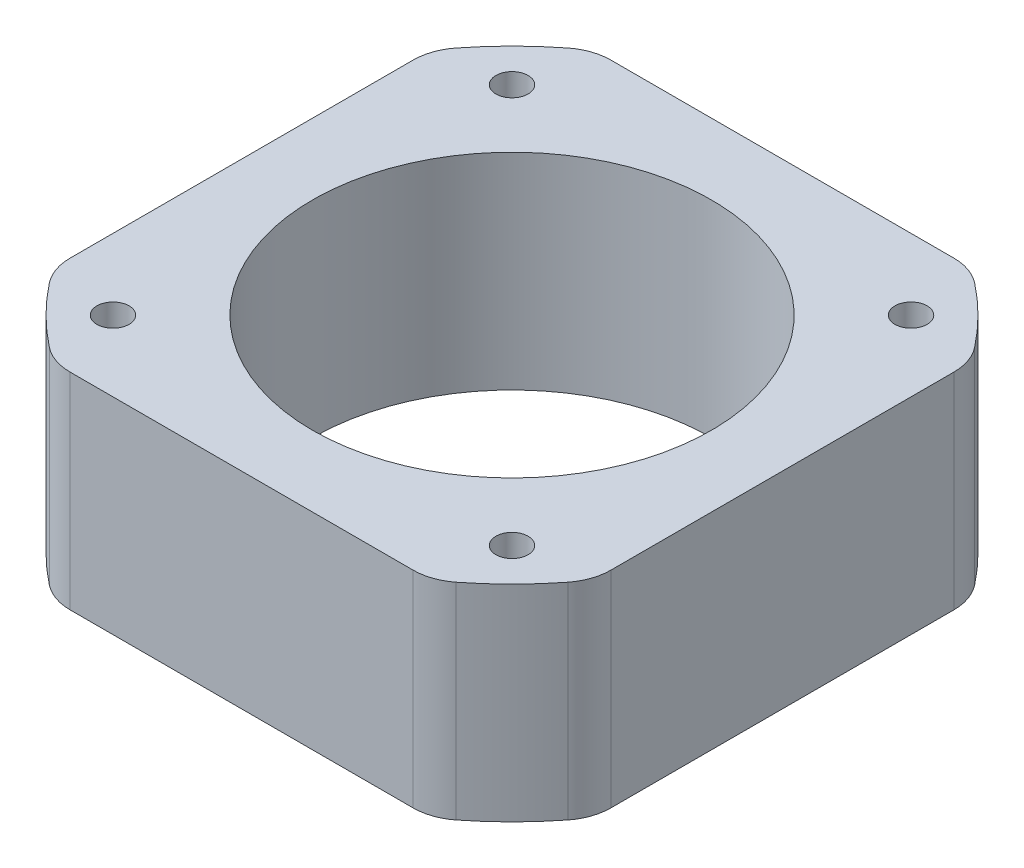
ISO-10303-21;
HEADER;
FILE_DESCRIPTION(('STEP AP214'),'2;1');
FILE_NAME('part.step','',(''),(''),'','','');
FILE_SCHEMA(('AUTOMOTIVE_DESIGN { 1 0 10303 214 1 1 1 1 }'));
ENDSEC;
DATA;
#1=APPLICATION_CONTEXT('core data for automotive mechanical design processes');
#2=APPLICATION_PROTOCOL_DEFINITION('international standard','automotive_design',2000,#1);
#3=PRODUCT_CONTEXT('',#1,'mechanical');
#4=PRODUCT('Part','Part','',(#3));
#5=PRODUCT_RELATED_PRODUCT_CATEGORY('part','',(#4));
#6=PRODUCT_DEFINITION_FORMATION('','',#4);
#7=PRODUCT_DEFINITION_CONTEXT('part definition',#1,'design');
#8=PRODUCT_DEFINITION('design','',#6,#7);
#9=PRODUCT_DEFINITION_SHAPE('','',#8);
#10=(LENGTH_UNIT() NAMED_UNIT(*) SI_UNIT(.MILLI.,.METRE.));
#11=(NAMED_UNIT(*) PLANE_ANGLE_UNIT() SI_UNIT($,.RADIAN.));
#12=(NAMED_UNIT(*) SI_UNIT($,.STERADIAN.) SOLID_ANGLE_UNIT());
#13=UNCERTAINTY_MEASURE_WITH_UNIT(LENGTH_MEASURE(1.E-05),#10,'distance_accuracy_value','');
#14=(GEOMETRIC_REPRESENTATION_CONTEXT(3) GLOBAL_UNCERTAINTY_ASSIGNED_CONTEXT((#13)) GLOBAL_UNIT_ASSIGNED_CONTEXT((#10,
#11,#12)) REPRESENTATION_CONTEXT('',''));
#15=CARTESIAN_POINT('',(0.,0.,0.));
#16=DIRECTION('',(0.,0.,1.));
#17=DIRECTION('',(1.,0.,0.));
#18=AXIS2_PLACEMENT_3D('',#15,#16,#17);
#19=CARTESIAN_POINT('',(0.,16.,0.));
#20=DIRECTION('',(0.,1.,0.));
#21=DIRECTION('',(0.,0.,1.));
#22=AXIS2_PLACEMENT_3D('',#19,#20,#21);
#23=PLANE('',#22);
#24=CARTESIAN_POINT('',(15.5,16.,15.5));
#25=DIRECTION('',(0.,1.,0.));
#26=DIRECTION('',(0.,0.,1.));
#27=AXIS2_PLACEMENT_3D('',#24,#25,#26);
#28=CIRCLE('',#27,1.25000000000001);
#29=CARTESIAN_POINT('',(15.5,16.,16.75));
#30=VERTEX_POINT('',#29);
#31=EDGE_CURVE('E319',#30,#30,#28,.T.);
#32=ORIENTED_EDGE('',*,*,#31,.F.);
#33=EDGE_LOOP('',(#32));
#34=FACE_BOUND('',#33,.T.);
#35=CARTESIAN_POINT('',(-15.5,16.,-15.5));
#36=DIRECTION('',(0.,1.,0.));
#37=DIRECTION('',(0.,0.,1.));
#38=AXIS2_PLACEMENT_3D('',#35,#36,#37);
#39=CIRCLE('',#38,1.25000000000001);
#40=CARTESIAN_POINT('',(-15.5,16.,-14.25));
#41=VERTEX_POINT('',#40);
#42=EDGE_CURVE('E307',#41,#41,#39,.T.);
#43=ORIENTED_EDGE('',*,*,#42,.F.);
#44=EDGE_LOOP('',(#43));
#45=FACE_BOUND('',#44,.T.);
#46=CARTESIAN_POINT('',(0.,16.,0.));
#47=DIRECTION('',(0.,1.,0.));
#48=DIRECTION('',(0.,0.,1.));
#49=AXIS2_PLACEMENT_3D('',#46,#47,#48);
#50=CIRCLE('',#49,25.6);
#51=CARTESIAN_POINT('',(-15.7927871574424,16.,-20.1481481481481));
#52=VERTEX_POINT('',#51);
#53=CARTESIAN_POINT('',(-20.1481481481482,16.,-15.7927871574423));
#54=VERTEX_POINT('',#53);
#55=EDGE_CURVE('E295',#52,#54,#50,.T.);
#56=ORIENTED_EDGE('',*,*,#55,.T.);
#57=CARTESIAN_POINT('',(-17.,16.,-13.325164164092));
#58=DIRECTION('',(0.,1.,0.));
#59=DIRECTION('',(0.,0.,1.));
#60=AXIS2_PLACEMENT_3D('',#57,#58,#59);
#61=CIRCLE('',#60,4.);
#62=CARTESIAN_POINT('',(-21.,16.,-13.325164164092));
#63=VERTEX_POINT('',#62);
#64=EDGE_CURVE('E223',#54,#63,#61,.T.);
#65=ORIENTED_EDGE('',*,*,#64,.T.);
#66=DIRECTION('',(0.,0.,1.));
#67=VECTOR('',#66,1.);
#68=CARTESIAN_POINT('',(-21.,16.,14.641038214553));
#69=LINE('',#68,#67);
#70=CARTESIAN_POINT('',(-21.,16.,13.325164164092));
#71=VERTEX_POINT('',#70);
#72=EDGE_CURVE('E168',#63,#71,#69,.T.);
#73=ORIENTED_EDGE('',*,*,#72,.T.);
#74=CARTESIAN_POINT('',(-17.,16.,13.325164164092));
#75=DIRECTION('',(0.,1.,0.));
#76=DIRECTION('',(0.,0.,1.));
#77=AXIS2_PLACEMENT_3D('',#74,#75,#76);
#78=CIRCLE('',#77,4.);
#79=CARTESIAN_POINT('',(-20.1481481481482,16.,15.7927871574423));
#80=VERTEX_POINT('',#79);
#81=EDGE_CURVE('E210',#71,#80,#78,.T.);
#82=ORIENTED_EDGE('',*,*,#81,.T.);
#83=CARTESIAN_POINT('',(0.,16.,0.));
#84=DIRECTION('',(0.,1.,0.));
#85=DIRECTION('',(0.,0.,1.));
#86=AXIS2_PLACEMENT_3D('',#83,#84,#85);
#87=CIRCLE('',#86,25.6);
#88=CARTESIAN_POINT('',(-15.7927871574423,16.,20.1481481481482));
#89=VERTEX_POINT('',#88);
#90=EDGE_CURVE('E255',#80,#89,#87,.T.);
#91=ORIENTED_EDGE('',*,*,#90,.T.);
#92=CARTESIAN_POINT('',(-13.325164164092,16.,17.));
#93=DIRECTION('',(0.,1.,0.));
#94=DIRECTION('',(0.,0.,1.));
#95=AXIS2_PLACEMENT_3D('',#92,#93,#94);
#96=CIRCLE('',#95,4.);
#97=CARTESIAN_POINT('',(-13.325164164092,16.,21.));
#98=VERTEX_POINT('',#97);
#99=EDGE_CURVE('E212',#89,#98,#96,.T.);
#100=ORIENTED_EDGE('',*,*,#99,.T.);
#101=DIRECTION('',(1.,0.,0.));
#102=VECTOR('',#101,1.);
#103=CARTESIAN_POINT('',(-14.641038214553,16.,21.));
#104=LINE('',#103,#102);
#105=CARTESIAN_POINT('',(13.3251641640919,16.,21.));
#106=VERTEX_POINT('',#105);
#107=EDGE_CURVE('E268',#98,#106,#104,.T.);
#108=ORIENTED_EDGE('',*,*,#107,.T.);
#109=CARTESIAN_POINT('',(13.3251641640919,16.,17.));
#110=DIRECTION('',(0.,1.,0.));
#111=DIRECTION('',(0.,0.,1.));
#112=AXIS2_PLACEMENT_3D('',#109,#110,#111);
#113=CIRCLE('',#112,4.);
#114=CARTESIAN_POINT('',(15.7927871574423,16.,20.1481481481482));
#115=VERTEX_POINT('',#114);
#116=EDGE_CURVE('E214',#106,#115,#113,.T.);
#117=ORIENTED_EDGE('',*,*,#116,.T.);
#118=CARTESIAN_POINT('',(0.,16.,0.));
#119=DIRECTION('',(0.,1.,0.));
#120=DIRECTION('',(0.,0.,1.));
#121=AXIS2_PLACEMENT_3D('',#118,#119,#120);
#122=CIRCLE('',#121,25.6);
#123=CARTESIAN_POINT('',(20.1481481481481,16.,15.7927871574423));
#124=VERTEX_POINT('',#123);
#125=EDGE_CURVE('E270',#115,#124,#122,.T.);
#126=ORIENTED_EDGE('',*,*,#125,.T.);
#127=CARTESIAN_POINT('',(17.,16.,13.3251641640919));
#128=DIRECTION('',(0.,1.,0.));
#129=DIRECTION('',(0.,0.,1.));
#130=AXIS2_PLACEMENT_3D('',#127,#128,#129);
#131=CIRCLE('',#130,4.);
#132=CARTESIAN_POINT('',(21.,16.,13.3251641640919));
#133=VERTEX_POINT('',#132);
#134=EDGE_CURVE('E56',#124,#133,#131,.T.);
#135=ORIENTED_EDGE('',*,*,#134,.T.);
#136=DIRECTION('',(0.,0.,-1.));
#137=VECTOR('',#136,1.);
#138=CARTESIAN_POINT('',(21.,16.,14.641038214553));
#139=LINE('',#138,#137);
#140=CARTESIAN_POINT('',(21.,16.,-13.3251641640919));
#141=VERTEX_POINT('',#140);
#142=EDGE_CURVE('E193',#133,#141,#139,.T.);
#143=ORIENTED_EDGE('',*,*,#142,.T.);
#144=CARTESIAN_POINT('',(17.,16.,-13.3251641640919));
#145=DIRECTION('',(0.,1.,0.));
#146=DIRECTION('',(0.,0.,1.));
#147=AXIS2_PLACEMENT_3D('',#144,#145,#146);
#148=CIRCLE('',#147,4.);
#149=CARTESIAN_POINT('',(20.1481481481481,16.,-15.7927871574423));
#150=VERTEX_POINT('',#149);
#151=EDGE_CURVE('E217',#141,#150,#148,.T.);
#152=ORIENTED_EDGE('',*,*,#151,.T.);
#153=CARTESIAN_POINT('',(0.,16.,0.));
#154=DIRECTION('',(0.,1.,0.));
#155=DIRECTION('',(0.,0.,1.));
#156=AXIS2_PLACEMENT_3D('',#153,#154,#155);
#157=CIRCLE('',#156,25.6);
#158=CARTESIAN_POINT('',(15.7927871574423,16.,-20.1481481481481));
#159=VERTEX_POINT('',#158);
#160=EDGE_CURVE('E192',#150,#159,#157,.T.);
#161=ORIENTED_EDGE('',*,*,#160,.T.);
#162=CARTESIAN_POINT('',(13.3251641640919,16.,-17.));
#163=DIRECTION('',(0.,1.,0.));
#164=DIRECTION('',(0.,0.,1.));
#165=AXIS2_PLACEMENT_3D('',#162,#163,#164);
#166=CIRCLE('',#165,4.);
#167=CARTESIAN_POINT('',(13.3251641640919,16.,-21.));
#168=VERTEX_POINT('',#167);
#169=EDGE_CURVE('E219',#159,#168,#166,.T.);
#170=ORIENTED_EDGE('',*,*,#169,.T.);
#171=DIRECTION('',(-1.,0.,0.));
#172=VECTOR('',#171,1.);
#173=CARTESIAN_POINT('',(-14.641038214553,16.,-21.));
#174=LINE('',#173,#172);
#175=CARTESIAN_POINT('',(-13.325164164092,16.,-21.));
#176=VERTEX_POINT('',#175);
#177=EDGE_CURVE('E296',#168,#176,#174,.T.);
#178=ORIENTED_EDGE('',*,*,#177,.T.);
#179=CARTESIAN_POINT('',(-13.325164164092,16.,-17.));
#180=DIRECTION('',(0.,1.,0.));
#181=DIRECTION('',(0.,0.,1.));
#182=AXIS2_PLACEMENT_3D('',#179,#180,#181);
#183=CIRCLE('',#182,4.);
#184=EDGE_CURVE('E221',#176,#52,#183,.T.);
#185=ORIENTED_EDGE('',*,*,#184,.T.);
#186=EDGE_LOOP('',(#56,#65,#73,#82,#91,#100,#108,#117,#126,#135,#143,#152,#161,#170,#178,#185));
#187=FACE_BOUND('',#186,.T.);
#188=CARTESIAN_POINT('',(0.,16.,0.));
#189=DIRECTION('',(0.,1.,0.));
#190=DIRECTION('',(0.,0.,1.));
#191=AXIS2_PLACEMENT_3D('',#188,#189,#190);
#192=CIRCLE('',#191,15.5);
#193=CARTESIAN_POINT('',(0.,16.,15.5));
#194=VERTEX_POINT('',#193);
#195=EDGE_CURVE('E279',#194,#194,#192,.T.);
#196=ORIENTED_EDGE('',*,*,#195,.F.);
#197=EDGE_LOOP('',(#196));
#198=FACE_BOUND('',#197,.T.);
#199=CARTESIAN_POINT('',(15.5,16.,-15.5));
#200=DIRECTION('',(0.,1.,0.));
#201=DIRECTION('',(0.,0.,1.));
#202=AXIS2_PLACEMENT_3D('',#199,#200,#201);
#203=CIRCLE('',#202,1.25000000000001);
#204=CARTESIAN_POINT('',(15.5,16.,-14.25));
#205=VERTEX_POINT('',#204);
#206=EDGE_CURVE('E313',#205,#205,#203,.T.);
#207=ORIENTED_EDGE('',*,*,#206,.F.);
#208=EDGE_LOOP('',(#207));
#209=FACE_BOUND('',#208,.T.);
#210=CARTESIAN_POINT('',(-15.5,16.,15.5));
#211=DIRECTION('',(0.,1.,0.));
#212=DIRECTION('',(0.,0.,1.));
#213=AXIS2_PLACEMENT_3D('',#210,#211,#212);
#214=CIRCLE('',#213,1.25000000000001);
#215=CARTESIAN_POINT('',(-15.5,16.,16.75));
#216=VERTEX_POINT('',#215);
#217=EDGE_CURVE('E325',#216,#216,#214,.T.);
#218=ORIENTED_EDGE('',*,*,#217,.F.);
#219=EDGE_LOOP('',(#218));
#220=FACE_BOUND('',#219,.T.);
#221=ADVANCED_FACE('F34',(#34,#45,#187,#198,#209,#220),#23,.T.);
#222=CARTESIAN_POINT('',(0.,0.,0.));
#223=DIRECTION('',(0.,1.,0.));
#224=DIRECTION('',(0.,0.,1.));
#225=AXIS2_PLACEMENT_3D('',#222,#223,#224);
#226=PLANE('',#225);
#227=CARTESIAN_POINT('',(15.5,0.,15.5));
#228=DIRECTION('',(0.,1.,0.));
#229=DIRECTION('',(0.,0.,1.));
#230=AXIS2_PLACEMENT_3D('',#227,#228,#229);
#231=CIRCLE('',#230,1.25000000000001);
#232=CARTESIAN_POINT('',(15.5,0.,16.75));
#233=VERTEX_POINT('',#232);
#234=EDGE_CURVE('E322',#233,#233,#231,.T.);
#235=ORIENTED_EDGE('',*,*,#234,.T.);
#236=EDGE_LOOP('',(#235));
#237=FACE_BOUND('',#236,.T.);
#238=CARTESIAN_POINT('',(-15.5,0.,-15.5));
#239=DIRECTION('',(0.,1.,0.));
#240=DIRECTION('',(0.,0.,1.));
#241=AXIS2_PLACEMENT_3D('',#238,#239,#240);
#242=CIRCLE('',#241,1.25000000000001);
#243=CARTESIAN_POINT('',(-15.5,0.,-14.25));
#244=VERTEX_POINT('',#243);
#245=EDGE_CURVE('E310',#244,#244,#242,.T.);
#246=ORIENTED_EDGE('',*,*,#245,.T.);
#247=EDGE_LOOP('',(#246));
#248=FACE_BOUND('',#247,.T.);
#249=DIRECTION('',(0.,0.,1.));
#250=VECTOR('',#249,1.);
#251=CARTESIAN_POINT('',(-21.,0.,14.641038214553));
#252=LINE('',#251,#250);
#253=CARTESIAN_POINT('',(-21.,0.,-13.325164164092));
#254=VERTEX_POINT('',#253);
#255=CARTESIAN_POINT('',(-21.,0.,13.325164164092));
#256=VERTEX_POINT('',#255);
#257=EDGE_CURVE('E165',#254,#256,#252,.T.);
#258=ORIENTED_EDGE('',*,*,#257,.F.);
#259=CARTESIAN_POINT('',(-17.,0.,-13.325164164092));
#260=DIRECTION('',(0.,1.,0.));
#261=DIRECTION('',(0.,0.,1.));
#262=AXIS2_PLACEMENT_3D('',#259,#260,#261);
#263=CIRCLE('',#262,4.);
#264=CARTESIAN_POINT('',(-20.1481481481482,0.,-15.7927871574423));
#265=VERTEX_POINT('',#264);
#266=EDGE_CURVE('E148',#254,#265,#263,.F.);
#267=ORIENTED_EDGE('',*,*,#266,.T.);
#268=CARTESIAN_POINT('',(0.,0.,0.));
#269=DIRECTION('',(0.,1.,0.));
#270=DIRECTION('',(0.,0.,1.));
#271=AXIS2_PLACEMENT_3D('',#268,#269,#270);
#272=CIRCLE('',#271,25.6);
#273=CARTESIAN_POINT('',(-15.7927871574424,0.,-20.1481481481481));
#274=VERTEX_POINT('',#273);
#275=EDGE_CURVE('E176',#274,#265,#272,.T.);
#276=ORIENTED_EDGE('',*,*,#275,.F.);
#277=CARTESIAN_POINT('',(-13.325164164092,0.,-17.));
#278=DIRECTION('',(0.,1.,0.));
#279=DIRECTION('',(0.,0.,1.));
#280=AXIS2_PLACEMENT_3D('',#277,#278,#279);
#281=CIRCLE('',#280,4.);
#282=CARTESIAN_POINT('',(-13.325164164092,0.,-21.));
#283=VERTEX_POINT('',#282);
#284=EDGE_CURVE('E159',#274,#283,#281,.F.);
#285=ORIENTED_EDGE('',*,*,#284,.T.);
#286=DIRECTION('',(-1.,0.,0.));
#287=VECTOR('',#286,1.);
#288=CARTESIAN_POINT('',(-14.641038214553,0.,-21.));
#289=LINE('',#288,#287);
#290=CARTESIAN_POINT('',(13.3251641640919,0.,-21.));
#291=VERTEX_POINT('',#290);
#292=EDGE_CURVE('E181',#291,#283,#289,.T.);
#293=ORIENTED_EDGE('',*,*,#292,.F.);
#294=CARTESIAN_POINT('',(13.3251641640919,0.,-17.));
#295=DIRECTION('',(0.,1.,0.));
#296=DIRECTION('',(0.,0.,1.));
#297=AXIS2_PLACEMENT_3D('',#294,#295,#296);
#298=CIRCLE('',#297,4.);
#299=CARTESIAN_POINT('',(15.7927871574423,0.,-20.1481481481481));
#300=VERTEX_POINT('',#299);
#301=EDGE_CURVE('E204',#291,#300,#298,.F.);
#302=ORIENTED_EDGE('',*,*,#301,.T.);
#303=CARTESIAN_POINT('',(0.,0.,0.));
#304=DIRECTION('',(0.,1.,0.));
#305=DIRECTION('',(0.,0.,1.));
#306=AXIS2_PLACEMENT_3D('',#303,#304,#305);
#307=CIRCLE('',#306,25.6);
#308=CARTESIAN_POINT('',(20.1481481481481,0.,-15.7927871574423));
#309=VERTEX_POINT('',#308);
#310=EDGE_CURVE('E277',#309,#300,#307,.T.);
#311=ORIENTED_EDGE('',*,*,#310,.F.);
#312=CARTESIAN_POINT('',(17.,0.,-13.3251641640919));
#313=DIRECTION('',(0.,1.,0.));
#314=DIRECTION('',(0.,0.,1.));
#315=AXIS2_PLACEMENT_3D('',#312,#313,#314);
#316=CIRCLE('',#315,4.);
#317=CARTESIAN_POINT('',(21.,0.,-13.3251641640919));
#318=VERTEX_POINT('',#317);
#319=EDGE_CURVE('E202',#309,#318,#316,.F.);
#320=ORIENTED_EDGE('',*,*,#319,.T.);
#321=DIRECTION('',(0.,0.,-1.));
#322=VECTOR('',#321,1.);
#323=CARTESIAN_POINT('',(21.,0.,14.641038214553));
#324=LINE('',#323,#322);
#325=CARTESIAN_POINT('',(21.,0.,13.3251641640919));
#326=VERTEX_POINT('',#325);
#327=EDGE_CURVE('E190',#326,#318,#324,.T.);
#328=ORIENTED_EDGE('',*,*,#327,.F.);
#329=CARTESIAN_POINT('',(17.,0.,13.3251641640919));
#330=DIRECTION('',(0.,1.,0.));
#331=DIRECTION('',(0.,0.,1.));
#332=AXIS2_PLACEMENT_3D('',#329,#330,#331);
#333=CIRCLE('',#332,4.);
#334=CARTESIAN_POINT('',(20.1481481481481,0.,15.7927871574423));
#335=VERTEX_POINT('',#334);
#336=EDGE_CURVE('E200',#326,#335,#333,.F.);
#337=ORIENTED_EDGE('',*,*,#336,.T.);
#338=CARTESIAN_POINT('',(0.,0.,0.));
#339=DIRECTION('',(0.,1.,0.));
#340=DIRECTION('',(0.,0.,1.));
#341=AXIS2_PLACEMENT_3D('',#338,#339,#340);
#342=CIRCLE('',#341,25.6);
#343=CARTESIAN_POINT('',(15.7927871574423,0.,20.1481481481482));
#344=VERTEX_POINT('',#343);
#345=EDGE_CURVE('E187',#344,#335,#342,.T.);
#346=ORIENTED_EDGE('',*,*,#345,.F.);
#347=CARTESIAN_POINT('',(13.3251641640919,0.,17.));
#348=DIRECTION('',(0.,1.,0.));
#349=DIRECTION('',(0.,0.,1.));
#350=AXIS2_PLACEMENT_3D('',#347,#348,#349);
#351=CIRCLE('',#350,4.);
#352=CARTESIAN_POINT('',(13.3251641640919,0.,21.));
#353=VERTEX_POINT('',#352);
#354=EDGE_CURVE('E198',#344,#353,#351,.F.);
#355=ORIENTED_EDGE('',*,*,#354,.T.);
#356=DIRECTION('',(1.,0.,0.));
#357=VECTOR('',#356,1.);
#358=CARTESIAN_POINT('',(-14.641038214553,0.,21.));
#359=LINE('',#358,#357);
#360=CARTESIAN_POINT('',(-13.325164164092,0.,21.));
#361=VERTEX_POINT('',#360);
#362=EDGE_CURVE('E179',#361,#353,#359,.T.);
#363=ORIENTED_EDGE('',*,*,#362,.F.);
#364=CARTESIAN_POINT('',(-13.325164164092,0.,17.));
#365=DIRECTION('',(0.,1.,0.));
#366=DIRECTION('',(0.,0.,1.));
#367=AXIS2_PLACEMENT_3D('',#364,#365,#366);
#368=CIRCLE('',#367,4.);
#369=CARTESIAN_POINT('',(-15.7927871574423,0.,20.1481481481482));
#370=VERTEX_POINT('',#369);
#371=EDGE_CURVE('E196',#361,#370,#368,.F.);
#372=ORIENTED_EDGE('',*,*,#371,.T.);
#373=CARTESIAN_POINT('',(0.,0.,0.));
#374=DIRECTION('',(0.,1.,0.));
#375=DIRECTION('',(0.,0.,1.));
#376=AXIS2_PLACEMENT_3D('',#373,#374,#375);
#377=CIRCLE('',#376,25.6);
#378=CARTESIAN_POINT('',(-20.1481481481482,0.,15.7927871574423));
#379=VERTEX_POINT('',#378);
#380=EDGE_CURVE('E175',#379,#370,#377,.T.);
#381=ORIENTED_EDGE('',*,*,#380,.F.);
#382=CARTESIAN_POINT('',(-17.,0.,13.325164164092));
#383=DIRECTION('',(0.,1.,0.));
#384=DIRECTION('',(0.,0.,1.));
#385=AXIS2_PLACEMENT_3D('',#382,#383,#384);
#386=CIRCLE('',#385,4.);
#387=EDGE_CURVE('E169',#379,#256,#386,.F.);
#388=ORIENTED_EDGE('',*,*,#387,.T.);
#389=EDGE_LOOP('',(#258,#267,#276,#285,#293,#302,#311,#320,#328,#337,#346,#355,#363,#372,#381,#388));
#390=FACE_BOUND('',#389,.T.);
#391=CARTESIAN_POINT('',(0.,0.,0.));
#392=DIRECTION('',(0.,1.,0.));
#393=DIRECTION('',(0.,0.,1.));
#394=AXIS2_PLACEMENT_3D('',#391,#392,#393);
#395=CIRCLE('',#394,15.5);
#396=CARTESIAN_POINT('',(0.,0.,15.5));
#397=VERTEX_POINT('',#396);
#398=EDGE_CURVE('E304',#397,#397,#395,.T.);
#399=ORIENTED_EDGE('',*,*,#398,.T.);
#400=EDGE_LOOP('',(#399));
#401=FACE_BOUND('',#400,.T.);
#402=CARTESIAN_POINT('',(15.5,0.,-15.5));
#403=DIRECTION('',(0.,1.,0.));
#404=DIRECTION('',(0.,0.,1.));
#405=AXIS2_PLACEMENT_3D('',#402,#403,#404);
#406=CIRCLE('',#405,1.25000000000001);
#407=CARTESIAN_POINT('',(15.5,0.,-14.25));
#408=VERTEX_POINT('',#407);
#409=EDGE_CURVE('E316',#408,#408,#406,.T.);
#410=ORIENTED_EDGE('',*,*,#409,.T.);
#411=EDGE_LOOP('',(#410));
#412=FACE_BOUND('',#411,.T.);
#413=CARTESIAN_POINT('',(-15.5,0.,15.5));
#414=DIRECTION('',(0.,1.,0.));
#415=DIRECTION('',(0.,0.,1.));
#416=AXIS2_PLACEMENT_3D('',#413,#414,#415);
#417=CIRCLE('',#416,1.25000000000001);
#418=CARTESIAN_POINT('',(-15.5,0.,16.75));
#419=VERTEX_POINT('',#418);
#420=EDGE_CURVE('E328',#419,#419,#417,.T.);
#421=ORIENTED_EDGE('',*,*,#420,.T.);
#422=EDGE_LOOP('',(#421));
#423=FACE_BOUND('',#422,.T.);
#424=ADVANCED_FACE('F172',(#237,#248,#390,#401,#412,#423),#226,.F.);
#425=CARTESIAN_POINT('',(0.,16.,0.));
#426=DIRECTION('',(0.,-1.,0.));
#427=DIRECTION('',(0.,0.,-1.));
#428=AXIS2_PLACEMENT_3D('',#425,#426,#427);
#429=CYLINDRICAL_SURFACE('',#428,25.6);
#430=ORIENTED_EDGE('',*,*,#310,.T.);
#431=DIRECTION('',(0.,-1.,0.));
#432=VECTOR('',#431,1.);
#433=CARTESIAN_POINT('',(15.7927871574423,16.,-20.1481481481482));
#434=LINE('',#433,#432);
#435=EDGE_CURVE('E233',#300,#159,#434,.F.);
#436=ORIENTED_EDGE('',*,*,#435,.T.);
#437=ORIENTED_EDGE('',*,*,#160,.F.);
#438=DIRECTION('',(0.,-1.,0.));
#439=VECTOR('',#438,1.);
#440=CARTESIAN_POINT('',(20.1481481481481,16.,-15.7927871574423));
#441=LINE('',#440,#439);
#442=EDGE_CURVE('E230',#150,#309,#441,.T.);
#443=ORIENTED_EDGE('',*,*,#442,.T.);
#444=EDGE_LOOP('',(#430,#436,#437,#443));
#445=FACE_BOUND('',#444,.T.);
#446=ADVANCED_FACE('F343',(#445),#429,.T.);
#447=CARTESIAN_POINT('',(-14.641038214553,16.,-21.));
#448=DIRECTION('',(0.,0.,1.));
#449=DIRECTION('',(1.,0.,0.));
#450=AXIS2_PLACEMENT_3D('',#447,#448,#449);
#451=PLANE('',#450);
#452=ORIENTED_EDGE('',*,*,#292,.T.);
#453=DIRECTION('',(0.,-1.,0.));
#454=VECTOR('',#453,1.);
#455=CARTESIAN_POINT('',(-13.325164164092,16.,-21.));
#456=LINE('',#455,#454);
#457=EDGE_CURVE('E228',#283,#176,#456,.F.);
#458=ORIENTED_EDGE('',*,*,#457,.T.);
#459=ORIENTED_EDGE('',*,*,#177,.F.);
#460=DIRECTION('',(0.,-1.,0.));
#461=VECTOR('',#460,1.);
#462=CARTESIAN_POINT('',(13.3251641640919,16.,-21.));
#463=LINE('',#462,#461);
#464=EDGE_CURVE('E225',#168,#291,#463,.T.);
#465=ORIENTED_EDGE('',*,*,#464,.T.);
#466=EDGE_LOOP('',(#452,#458,#459,#465));
#467=FACE_BOUND('',#466,.T.);
#468=ADVANCED_FACE('F284',(#467),#451,.F.);
#469=CARTESIAN_POINT('',(0.,16.,0.));
#470=DIRECTION('',(0.,-1.,0.));
#471=DIRECTION('',(0.,0.,-1.));
#472=AXIS2_PLACEMENT_3D('',#469,#470,#471);
#473=CYLINDRICAL_SURFACE('',#472,25.6);
#474=ORIENTED_EDGE('',*,*,#275,.T.);
#475=DIRECTION('',(0.,-1.,0.));
#476=VECTOR('',#475,1.);
#477=CARTESIAN_POINT('',(-20.1481481481482,16.,-15.7927871574423));
#478=LINE('',#477,#476);
#479=EDGE_CURVE('E153',#265,#54,#478,.F.);
#480=ORIENTED_EDGE('',*,*,#479,.T.);
#481=ORIENTED_EDGE('',*,*,#55,.F.);
#482=DIRECTION('',(0.,-1.,0.));
#483=VECTOR('',#482,1.);
#484=CARTESIAN_POINT('',(-15.7927871574424,16.,-20.1481481481482));
#485=LINE('',#484,#483);
#486=EDGE_CURVE('E158',#52,#274,#485,.T.);
#487=ORIENTED_EDGE('',*,*,#486,.T.);
#488=EDGE_LOOP('',(#474,#480,#481,#487));
#489=FACE_BOUND('',#488,.T.);
#490=ADVANCED_FACE('F298',(#489),#473,.T.);
#491=CARTESIAN_POINT('',(-21.,16.,14.641038214553));
#492=DIRECTION('',(1.,0.,0.));
#493=DIRECTION('',(0.,0.,-1.));
#494=AXIS2_PLACEMENT_3D('',#491,#492,#493);
#495=PLANE('',#494);
#496=ORIENTED_EDGE('',*,*,#72,.F.);
#497=DIRECTION('',(0.,-1.,0.));
#498=VECTOR('',#497,1.);
#499=CARTESIAN_POINT('',(-21.,16.,-13.325164164092));
#500=LINE('',#499,#498);
#501=EDGE_CURVE('E152',#63,#254,#500,.T.);
#502=ORIENTED_EDGE('',*,*,#501,.T.);
#503=ORIENTED_EDGE('',*,*,#257,.T.);
#504=DIRECTION('',(0.,-1.,0.));
#505=VECTOR('',#504,1.);
#506=CARTESIAN_POINT('',(-21.,16.,13.325164164092));
#507=LINE('',#506,#505);
#508=EDGE_CURVE('E170',#256,#71,#507,.F.);
#509=ORIENTED_EDGE('',*,*,#508,.T.);
#510=EDGE_LOOP('',(#496,#502,#503,#509));
#511=FACE_BOUND('',#510,.T.);
#512=ADVANCED_FACE('F164',(#511),#495,.F.);
#513=CARTESIAN_POINT('',(0.,16.,0.));
#514=DIRECTION('',(0.,-1.,0.));
#515=DIRECTION('',(0.,0.,-1.));
#516=AXIS2_PLACEMENT_3D('',#513,#514,#515);
#517=CYLINDRICAL_SURFACE('',#516,25.6);
#518=ORIENTED_EDGE('',*,*,#380,.T.);
#519=DIRECTION('',(0.,-1.,0.));
#520=VECTOR('',#519,1.);
#521=CARTESIAN_POINT('',(-15.7927871574423,16.,20.1481481481482));
#522=LINE('',#521,#520);
#523=EDGE_CURVE('E11',#370,#89,#522,.F.);
#524=ORIENTED_EDGE('',*,*,#523,.T.);
#525=ORIENTED_EDGE('',*,*,#90,.F.);
#526=DIRECTION('',(0.,-1.,0.));
#527=VECTOR('',#526,1.);
#528=CARTESIAN_POINT('',(-20.1481481481482,16.,15.7927871574423));
#529=LINE('',#528,#527);
#530=EDGE_CURVE('E42',#80,#379,#529,.T.);
#531=ORIENTED_EDGE('',*,*,#530,.T.);
#532=EDGE_LOOP('',(#518,#524,#525,#531));
#533=FACE_BOUND('',#532,.T.);
#534=ADVANCED_FACE('F252',(#533),#517,.T.);
#535=CARTESIAN_POINT('',(-14.641038214553,16.,21.));
#536=DIRECTION('',(0.,0.,-1.));
#537=DIRECTION('',(-1.,0.,0.));
#538=AXIS2_PLACEMENT_3D('',#535,#536,#537);
#539=PLANE('',#538);
#540=ORIENTED_EDGE('',*,*,#362,.T.);
#541=DIRECTION('',(0.,-1.,0.));
#542=VECTOR('',#541,1.);
#543=CARTESIAN_POINT('',(13.3251641640919,16.,21.));
#544=LINE('',#543,#542);
#545=EDGE_CURVE('E247',#353,#106,#544,.F.);
#546=ORIENTED_EDGE('',*,*,#545,.T.);
#547=ORIENTED_EDGE('',*,*,#107,.F.);
#548=DIRECTION('',(0.,-1.,0.));
#549=VECTOR('',#548,1.);
#550=CARTESIAN_POINT('',(-13.325164164092,16.,21.));
#551=LINE('',#550,#549);
#552=EDGE_CURVE('E244',#98,#361,#551,.T.);
#553=ORIENTED_EDGE('',*,*,#552,.T.);
#554=EDGE_LOOP('',(#540,#546,#547,#553));
#555=FACE_BOUND('',#554,.T.);
#556=ADVANCED_FACE('F265',(#555),#539,.F.);
#557=CARTESIAN_POINT('',(0.,16.,0.));
#558=DIRECTION('',(0.,-1.,0.));
#559=DIRECTION('',(0.,0.,-1.));
#560=AXIS2_PLACEMENT_3D('',#557,#558,#559);
#561=CYLINDRICAL_SURFACE('',#560,25.6);
#562=ORIENTED_EDGE('',*,*,#345,.T.);
#563=DIRECTION('',(0.,-1.,0.));
#564=VECTOR('',#563,1.);
#565=CARTESIAN_POINT('',(20.1481481481481,16.,15.7927871574423));
#566=LINE('',#565,#564);
#567=EDGE_CURVE('E242',#335,#124,#566,.F.);
#568=ORIENTED_EDGE('',*,*,#567,.T.);
#569=ORIENTED_EDGE('',*,*,#125,.F.);
#570=DIRECTION('',(0.,-1.,0.));
#571=VECTOR('',#570,1.);
#572=CARTESIAN_POINT('',(15.7927871574423,16.,20.1481481481482));
#573=LINE('',#572,#571);
#574=EDGE_CURVE('E239',#115,#344,#573,.T.);
#575=ORIENTED_EDGE('',*,*,#574,.T.);
#576=EDGE_LOOP('',(#562,#568,#569,#575));
#577=FACE_BOUND('',#576,.T.);
#578=ADVANCED_FACE('F355',(#577),#561,.T.);
#579=CARTESIAN_POINT('',(21.,16.,14.641038214553));
#580=DIRECTION('',(-1.,0.,0.));
#581=DIRECTION('',(0.,0.,1.));
#582=AXIS2_PLACEMENT_3D('',#579,#580,#581);
#583=PLANE('',#582);
#584=ORIENTED_EDGE('',*,*,#327,.T.);
#585=DIRECTION('',(0.,-1.,0.));
#586=VECTOR('',#585,1.);
#587=CARTESIAN_POINT('',(21.,16.,-13.3251641640919));
#588=LINE('',#587,#586);
#589=EDGE_CURVE('E49',#318,#141,#588,.F.);
#590=ORIENTED_EDGE('',*,*,#589,.T.);
#591=ORIENTED_EDGE('',*,*,#142,.F.);
#592=DIRECTION('',(0.,-1.,0.));
#593=VECTOR('',#592,1.);
#594=CARTESIAN_POINT('',(21.,16.,13.3251641640919));
#595=LINE('',#594,#593);
#596=EDGE_CURVE('E235',#133,#326,#595,.T.);
#597=ORIENTED_EDGE('',*,*,#596,.T.);
#598=EDGE_LOOP('',(#584,#590,#591,#597));
#599=FACE_BOUND('',#598,.T.);
#600=ADVANCED_FACE('F352',(#599),#583,.F.);
#601=CARTESIAN_POINT('',(0.,16.,0.));
#602=DIRECTION('',(0.,-1.,0.));
#603=DIRECTION('',(0.,0.,-1.));
#604=AXIS2_PLACEMENT_3D('',#601,#602,#603);
#605=CYLINDRICAL_SURFACE('',#604,15.5);
#606=ORIENTED_EDGE('',*,*,#195,.T.);
#607=EDGE_LOOP('',(#606));
#608=FACE_BOUND('',#607,.T.);
#609=ORIENTED_EDGE('',*,*,#398,.F.);
#610=EDGE_LOOP('',(#609));
#611=FACE_BOUND('',#610,.T.);
#612=ADVANCED_FACE('F349',(#608,#611),#605,.F.);
#613=CARTESIAN_POINT('',(-15.5,16.,-15.5));
#614=DIRECTION('',(0.,-1.,0.));
#615=DIRECTION('',(0.,0.,-1.));
#616=AXIS2_PLACEMENT_3D('',#613,#614,#615);
#617=CYLINDRICAL_SURFACE('',#616,1.25000000000001);
#618=ORIENTED_EDGE('',*,*,#42,.T.);
#619=EDGE_LOOP('',(#618));
#620=FACE_BOUND('',#619,.T.);
#621=ORIENTED_EDGE('',*,*,#245,.F.);
#622=EDGE_LOOP('',(#621));
#623=FACE_BOUND('',#622,.T.);
#624=ADVANCED_FACE('F525',(#620,#623),#617,.F.);
#625=CARTESIAN_POINT('',(15.5,16.,-15.5));
#626=DIRECTION('',(0.,-1.,0.));
#627=DIRECTION('',(0.,0.,-1.));
#628=AXIS2_PLACEMENT_3D('',#625,#626,#627);
#629=CYLINDRICAL_SURFACE('',#628,1.25000000000001);
#630=ORIENTED_EDGE('',*,*,#206,.T.);
#631=EDGE_LOOP('',(#630));
#632=FACE_BOUND('',#631,.T.);
#633=ORIENTED_EDGE('',*,*,#409,.F.);
#634=EDGE_LOOP('',(#633));
#635=FACE_BOUND('',#634,.T.);
#636=ADVANCED_FACE('F515',(#632,#635),#629,.F.);
#637=CARTESIAN_POINT('',(15.5,16.,15.5));
#638=DIRECTION('',(0.,-1.,0.));
#639=DIRECTION('',(0.,0.,-1.));
#640=AXIS2_PLACEMENT_3D('',#637,#638,#639);
#641=CYLINDRICAL_SURFACE('',#640,1.25000000000001);
#642=ORIENTED_EDGE('',*,*,#31,.T.);
#643=EDGE_LOOP('',(#642));
#644=FACE_BOUND('',#643,.T.);
#645=ORIENTED_EDGE('',*,*,#234,.F.);
#646=EDGE_LOOP('',(#645));
#647=FACE_BOUND('',#646,.T.);
#648=ADVANCED_FACE('F506',(#644,#647),#641,.F.);
#649=CARTESIAN_POINT('',(-15.5,16.,15.5));
#650=DIRECTION('',(0.,-1.,0.));
#651=DIRECTION('',(0.,0.,-1.));
#652=AXIS2_PLACEMENT_3D('',#649,#650,#651);
#653=CYLINDRICAL_SURFACE('',#652,1.25000000000001);
#654=ORIENTED_EDGE('',*,*,#217,.T.);
#655=EDGE_LOOP('',(#654));
#656=FACE_BOUND('',#655,.T.);
#657=ORIENTED_EDGE('',*,*,#420,.F.);
#658=EDGE_LOOP('',(#657));
#659=FACE_BOUND('',#658,.T.);
#660=ADVANCED_FACE('F334',(#656,#659),#653,.F.);
#661=CARTESIAN_POINT('',(-17.,16.,-13.325164164092));
#662=DIRECTION('',(0.,-1.,0.));
#663=DIRECTION('',(0.,0.,-1.));
#664=AXIS2_PLACEMENT_3D('',#661,#662,#663);
#665=CYLINDRICAL_SURFACE('',#664,4.);
#666=ORIENTED_EDGE('',*,*,#64,.F.);
#667=ORIENTED_EDGE('',*,*,#479,.F.);
#668=ORIENTED_EDGE('',*,*,#266,.F.);
#669=ORIENTED_EDGE('',*,*,#501,.F.);
#670=EDGE_LOOP('',(#666,#667,#668,#669));
#671=FACE_BOUND('',#670,.T.);
#672=ADVANCED_FACE('F151',(#671),#665,.T.);
#673=CARTESIAN_POINT('',(-13.325164164092,16.,-17.));
#674=DIRECTION('',(0.,-1.,0.));
#675=DIRECTION('',(0.,0.,-1.));
#676=AXIS2_PLACEMENT_3D('',#673,#674,#675);
#677=CYLINDRICAL_SURFACE('',#676,4.);
#678=ORIENTED_EDGE('',*,*,#184,.F.);
#679=ORIENTED_EDGE('',*,*,#457,.F.);
#680=ORIENTED_EDGE('',*,*,#284,.F.);
#681=ORIENTED_EDGE('',*,*,#486,.F.);
#682=EDGE_LOOP('',(#678,#679,#680,#681));
#683=FACE_BOUND('',#682,.T.);
#684=ADVANCED_FACE('F290',(#683),#677,.T.);
#685=CARTESIAN_POINT('',(13.3251641640919,16.,-17.));
#686=DIRECTION('',(0.,-1.,0.));
#687=DIRECTION('',(0.,0.,-1.));
#688=AXIS2_PLACEMENT_3D('',#685,#686,#687);
#689=CYLINDRICAL_SURFACE('',#688,4.);
#690=ORIENTED_EDGE('',*,*,#169,.F.);
#691=ORIENTED_EDGE('',*,*,#435,.F.);
#692=ORIENTED_EDGE('',*,*,#301,.F.);
#693=ORIENTED_EDGE('',*,*,#464,.F.);
#694=EDGE_LOOP('',(#690,#691,#692,#693));
#695=FACE_BOUND('',#694,.T.);
#696=ADVANCED_FACE('F376',(#695),#689,.T.);
#697=CARTESIAN_POINT('',(17.,16.,-13.3251641640919));
#698=DIRECTION('',(0.,-1.,0.));
#699=DIRECTION('',(0.,0.,-1.));
#700=AXIS2_PLACEMENT_3D('',#697,#698,#699);
#701=CYLINDRICAL_SURFACE('',#700,4.);
#702=ORIENTED_EDGE('',*,*,#151,.F.);
#703=ORIENTED_EDGE('',*,*,#589,.F.);
#704=ORIENTED_EDGE('',*,*,#319,.F.);
#705=ORIENTED_EDGE('',*,*,#442,.F.);
#706=EDGE_LOOP('',(#702,#703,#704,#705));
#707=FACE_BOUND('',#706,.T.);
#708=ADVANCED_FACE('F379',(#707),#701,.T.);
#709=CARTESIAN_POINT('',(17.,16.,13.3251641640919));
#710=DIRECTION('',(0.,-1.,0.));
#711=DIRECTION('',(0.,0.,-1.));
#712=AXIS2_PLACEMENT_3D('',#709,#710,#711);
#713=CYLINDRICAL_SURFACE('',#712,4.);
#714=ORIENTED_EDGE('',*,*,#134,.F.);
#715=ORIENTED_EDGE('',*,*,#567,.F.);
#716=ORIENTED_EDGE('',*,*,#336,.F.);
#717=ORIENTED_EDGE('',*,*,#596,.F.);
#718=EDGE_LOOP('',(#714,#715,#716,#717));
#719=FACE_BOUND('',#718,.T.);
#720=ADVANCED_FACE('F383',(#719),#713,.T.);
#721=CARTESIAN_POINT('',(13.3251641640919,16.,17.));
#722=DIRECTION('',(0.,-1.,0.));
#723=DIRECTION('',(0.,0.,-1.));
#724=AXIS2_PLACEMENT_3D('',#721,#722,#723);
#725=CYLINDRICAL_SURFACE('',#724,4.);
#726=ORIENTED_EDGE('',*,*,#116,.F.);
#727=ORIENTED_EDGE('',*,*,#545,.F.);
#728=ORIENTED_EDGE('',*,*,#354,.F.);
#729=ORIENTED_EDGE('',*,*,#574,.F.);
#730=EDGE_LOOP('',(#726,#727,#728,#729));
#731=FACE_BOUND('',#730,.T.);
#732=ADVANCED_FACE('F387',(#731),#725,.T.);
#733=CARTESIAN_POINT('',(-13.325164164092,16.,17.));
#734=DIRECTION('',(0.,-1.,0.));
#735=DIRECTION('',(0.,0.,-1.));
#736=AXIS2_PLACEMENT_3D('',#733,#734,#735);
#737=CYLINDRICAL_SURFACE('',#736,4.);
#738=ORIENTED_EDGE('',*,*,#99,.F.);
#739=ORIENTED_EDGE('',*,*,#523,.F.);
#740=ORIENTED_EDGE('',*,*,#371,.F.);
#741=ORIENTED_EDGE('',*,*,#552,.F.);
#742=EDGE_LOOP('',(#738,#739,#740,#741));
#743=FACE_BOUND('',#742,.T.);
#744=ADVANCED_FACE('F262',(#743),#737,.T.);
#745=CARTESIAN_POINT('',(-17.,16.,13.325164164092));
#746=DIRECTION('',(0.,-1.,0.));
#747=DIRECTION('',(0.,0.,-1.));
#748=AXIS2_PLACEMENT_3D('',#745,#746,#747);
#749=CYLINDRICAL_SURFACE('',#748,4.);
#750=ORIENTED_EDGE('',*,*,#81,.F.);
#751=ORIENTED_EDGE('',*,*,#508,.F.);
#752=ORIENTED_EDGE('',*,*,#387,.F.);
#753=ORIENTED_EDGE('',*,*,#530,.F.);
#754=EDGE_LOOP('',(#750,#751,#752,#753));
#755=FACE_BOUND('',#754,.T.);
#756=ADVANCED_FACE('F36',(#755),#749,.T.);
#757=CLOSED_SHELL('',(#221,#424,#446,#468,#490,#512,#534,#556,#578,#600,#612,#624,#636,#648,
#660,#672,#684,#696,#708,#720,#732,#744,#756));
#758=MANIFOLD_SOLID_BREP('B2',#757);
#759=ADVANCED_BREP_SHAPE_REPRESENTATION('',(#18,#758),#14);
#760=SHAPE_DEFINITION_REPRESENTATION(#9,#759);
ENDSEC;
END-ISO-10303-21;
